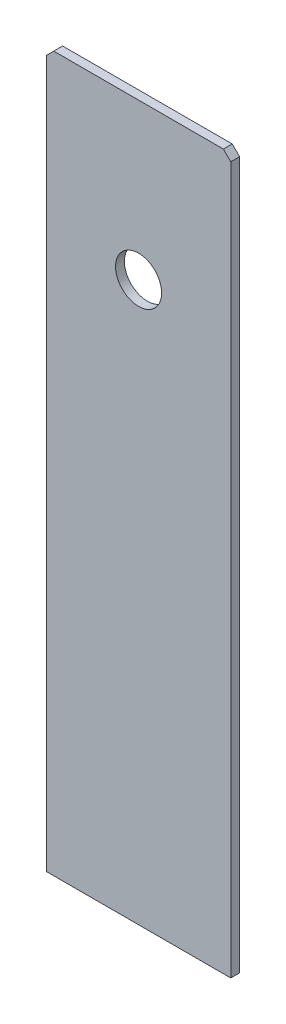
ISO-10303-21;
HEADER;
FILE_DESCRIPTION(('STEP AP214'),'2;1');
FILE_NAME('part.step','',(''),(''),'','','');
FILE_SCHEMA(('AUTOMOTIVE_DESIGN { 1 0 10303 214 1 1 1 1 }'));
ENDSEC;
DATA;
#1=APPLICATION_CONTEXT('core data for automotive mechanical design processes');
#2=APPLICATION_PROTOCOL_DEFINITION('international standard','automotive_design',2000,#1);
#3=PRODUCT_CONTEXT('',#1,'mechanical');
#4=PRODUCT('Part','Part','',(#3));
#5=PRODUCT_RELATED_PRODUCT_CATEGORY('part','',(#4));
#6=PRODUCT_DEFINITION_FORMATION('','',#4);
#7=PRODUCT_DEFINITION_CONTEXT('part definition',#1,'design');
#8=PRODUCT_DEFINITION('design','',#6,#7);
#9=PRODUCT_DEFINITION_SHAPE('','',#8);
#10=(LENGTH_UNIT() NAMED_UNIT(*) SI_UNIT(.MILLI.,.METRE.));
#11=(NAMED_UNIT(*) PLANE_ANGLE_UNIT() SI_UNIT($,.RADIAN.));
#12=(NAMED_UNIT(*) SI_UNIT($,.STERADIAN.) SOLID_ANGLE_UNIT());
#13=UNCERTAINTY_MEASURE_WITH_UNIT(LENGTH_MEASURE(1.E-05),#10,'distance_accuracy_value','');
#14=(GEOMETRIC_REPRESENTATION_CONTEXT(3) GLOBAL_UNCERTAINTY_ASSIGNED_CONTEXT((#13)) GLOBAL_UNIT_ASSIGNED_CONTEXT((#10,
#11,#12)) REPRESENTATION_CONTEXT('',''));
#15=CARTESIAN_POINT('',(0.,0.,0.));
#16=DIRECTION('',(0.,0.,1.));
#17=DIRECTION('',(1.,0.,0.));
#18=AXIS2_PLACEMENT_3D('',#15,#16,#17);
#19=CARTESIAN_POINT('',(0.,0.,3.048));
#20=DIRECTION('',(0.,0.,-1.));
#21=DIRECTION('',(-1.,0.,0.));
#22=AXIS2_PLACEMENT_3D('',#19,#20,#21);
#23=PLANE('',#22);
#24=DIRECTION('',(-1.,0.,0.));
#25=VECTOR('',#24,1.);
#26=CARTESIAN_POINT('',(0.,245.9736,3.048));
#27=LINE('',#26,#25);
#28=CARTESIAN_POINT('',(60.96,245.9736,3.048));
#29=VERTEX_POINT('',#28);
#30=CARTESIAN_POINT('',(2.53999999999996,245.9736,3.048));
#31=VERTEX_POINT('',#30);
#32=EDGE_CURVE('E117',#29,#31,#27,.T.);
#33=ORIENTED_EDGE('',*,*,#32,.T.);
#34=DIRECTION('',(0.707106781186547,0.707106781186548,0.));
#35=VECTOR('',#34,1.);
#36=CARTESIAN_POINT('',(0.,243.4336,3.048));
#37=LINE('',#36,#35);
#38=CARTESIAN_POINT('',(0.,243.4336,3.048));
#39=VERTEX_POINT('',#38);
#40=EDGE_CURVE('E43',#31,#39,#37,.F.);
#41=ORIENTED_EDGE('',*,*,#40,.T.);
#42=DIRECTION('',(0.,-1.,0.));
#43=VECTOR('',#42,1.);
#44=CARTESIAN_POINT('',(0.,0.,3.048));
#45=LINE('',#44,#43);
#46=CARTESIAN_POINT('',(0.,0.,3.048));
#47=VERTEX_POINT('',#46);
#48=EDGE_CURVE('E89',#39,#47,#45,.T.);
#49=ORIENTED_EDGE('',*,*,#48,.T.);
#50=DIRECTION('',(1.,0.,0.));
#51=VECTOR('',#50,1.);
#52=CARTESIAN_POINT('',(0.,0.,3.048));
#53=LINE('',#52,#51);
#54=CARTESIAN_POINT('',(63.5,0.,3.048));
#55=VERTEX_POINT('',#54);
#56=EDGE_CURVE('E92',#47,#55,#53,.T.);
#57=ORIENTED_EDGE('',*,*,#56,.T.);
#58=DIRECTION('',(0.,1.,0.));
#59=VECTOR('',#58,1.);
#60=CARTESIAN_POINT('',(63.5,0.,3.048));
#61=LINE('',#60,#59);
#62=CARTESIAN_POINT('',(63.5,243.4336,3.048));
#63=VERTEX_POINT('',#62);
#64=EDGE_CURVE('E107',#55,#63,#61,.T.);
#65=ORIENTED_EDGE('',*,*,#64,.T.);
#66=DIRECTION('',(0.707106781186544,-0.707106781186551,0.));
#67=VECTOR('',#66,1.);
#68=CARTESIAN_POINT('',(60.96,245.9736,3.048));
#69=LINE('',#68,#67);
#70=EDGE_CURVE('E128',#63,#29,#69,.F.);
#71=ORIENTED_EDGE('',*,*,#70,.T.);
#72=EDGE_LOOP('',(#33,#41,#49,#57,#65,#71));
#73=FACE_BOUND('',#72,.T.);
#74=CARTESIAN_POINT('',(31.75,192.3796,3.048));
#75=DIRECTION('',(0.,0.,1.));
#76=DIRECTION('',(1.,0.,0.));
#77=AXIS2_PLACEMENT_3D('',#74,#75,#76);
#78=CIRCLE('',#77,7.9375);
#79=CARTESIAN_POINT('',(39.6875,192.3796,3.048));
#80=VERTEX_POINT('',#79);
#81=EDGE_CURVE('E145',#80,#80,#78,.T.);
#82=ORIENTED_EDGE('',*,*,#81,.F.);
#83=EDGE_LOOP('',(#82));
#84=FACE_BOUND('',#83,.T.);
#85=ADVANCED_FACE('F35',(#73,#84),#23,.F.);
#86=CARTESIAN_POINT('',(0.,0.,0.));
#87=DIRECTION('',(0.,0.,-1.));
#88=DIRECTION('',(-1.,0.,0.));
#89=AXIS2_PLACEMENT_3D('',#86,#87,#88);
#90=PLANE('',#89);
#91=DIRECTION('',(0.,-1.,0.));
#92=VECTOR('',#91,1.);
#93=CARTESIAN_POINT('',(0.,0.,0.));
#94=LINE('',#93,#92);
#95=CARTESIAN_POINT('',(0.,243.4336,0.));
#96=VERTEX_POINT('',#95);
#97=CARTESIAN_POINT('',(0.,0.,0.));
#98=VERTEX_POINT('',#97);
#99=EDGE_CURVE('E111',#96,#98,#94,.T.);
#100=ORIENTED_EDGE('',*,*,#99,.F.);
#101=DIRECTION('',(-0.707106781186547,-0.707106781186548,0.));
#102=VECTOR('',#101,1.);
#103=CARTESIAN_POINT('',(-121.7168,121.7168,0.));
#104=LINE('',#103,#102);
#105=CARTESIAN_POINT('',(2.53999999999996,245.9736,0.));
#106=VERTEX_POINT('',#105);
#107=EDGE_CURVE('E122',#96,#106,#104,.F.);
#108=ORIENTED_EDGE('',*,*,#107,.T.);
#109=DIRECTION('',(-1.,0.,0.));
#110=VECTOR('',#109,1.);
#111=CARTESIAN_POINT('',(0.,245.9736,0.));
#112=LINE('',#111,#110);
#113=CARTESIAN_POINT('',(60.96,245.9736,0.));
#114=VERTEX_POINT('',#113);
#115=EDGE_CURVE('E99',#114,#106,#112,.T.);
#116=ORIENTED_EDGE('',*,*,#115,.F.);
#117=DIRECTION('',(-0.707106781186544,0.707106781186551,0.));
#118=VECTOR('',#117,1.);
#119=CARTESIAN_POINT('',(153.4668,153.466799999999,0.));
#120=LINE('',#119,#118);
#121=CARTESIAN_POINT('',(63.5,243.4336,0.));
#122=VERTEX_POINT('',#121);
#123=EDGE_CURVE('E115',#114,#122,#120,.F.);
#124=ORIENTED_EDGE('',*,*,#123,.T.);
#125=DIRECTION('',(0.,1.,0.));
#126=VECTOR('',#125,1.);
#127=CARTESIAN_POINT('',(63.5,0.,0.));
#128=LINE('',#127,#126);
#129=CARTESIAN_POINT('',(63.5,0.,0.));
#130=VERTEX_POINT('',#129);
#131=EDGE_CURVE('E139',#130,#122,#128,.T.);
#132=ORIENTED_EDGE('',*,*,#131,.F.);
#133=DIRECTION('',(1.,0.,0.));
#134=VECTOR('',#133,1.);
#135=CARTESIAN_POINT('',(0.,0.,0.));
#136=LINE('',#135,#134);
#137=EDGE_CURVE('E141',#98,#130,#136,.T.);
#138=ORIENTED_EDGE('',*,*,#137,.F.);
#139=EDGE_LOOP('',(#100,#108,#116,#124,#132,#138));
#140=FACE_BOUND('',#139,.T.);
#141=CARTESIAN_POINT('',(31.75,192.3796,0.));
#142=DIRECTION('',(0.,0.,1.));
#143=DIRECTION('',(1.,0.,0.));
#144=AXIS2_PLACEMENT_3D('',#141,#142,#143);
#145=CIRCLE('',#144,7.9375);
#146=CARTESIAN_POINT('',(39.6875,192.3796,0.));
#147=VERTEX_POINT('',#146);
#148=EDGE_CURVE('E148',#147,#147,#145,.T.);
#149=ORIENTED_EDGE('',*,*,#148,.T.);
#150=EDGE_LOOP('',(#149));
#151=FACE_BOUND('',#150,.T.);
#152=ADVANCED_FACE('F137',(#140,#151),#90,.T.);
#153=CARTESIAN_POINT('',(0.,0.,3.048));
#154=DIRECTION('',(1.,0.,0.));
#155=DIRECTION('',(0.,0.,-1.));
#156=AXIS2_PLACEMENT_3D('',#153,#154,#155);
#157=PLANE('',#156);
#158=ORIENTED_EDGE('',*,*,#48,.F.);
#159=DIRECTION('',(0.,0.,-1.));
#160=VECTOR('',#159,1.);
#161=CARTESIAN_POINT('',(0.,243.4336,3.048));
#162=LINE('',#161,#160);
#163=EDGE_CURVE('E113',#39,#96,#162,.T.);
#164=ORIENTED_EDGE('',*,*,#163,.T.);
#165=ORIENTED_EDGE('',*,*,#99,.T.);
#166=DIRECTION('',(0.,0.,-1.));
#167=VECTOR('',#166,1.);
#168=CARTESIAN_POINT('',(0.,0.,3.048));
#169=LINE('',#168,#167);
#170=EDGE_CURVE('E104',#47,#98,#169,.T.);
#171=ORIENTED_EDGE('',*,*,#170,.F.);
#172=EDGE_LOOP('',(#158,#164,#165,#171));
#173=FACE_BOUND('',#172,.T.);
#174=ADVANCED_FACE('F109',(#173),#157,.F.);
#175=CARTESIAN_POINT('',(0.,0.,3.048));
#176=DIRECTION('',(0.,1.,0.));
#177=DIRECTION('',(0.,0.,1.));
#178=AXIS2_PLACEMENT_3D('',#175,#176,#177);
#179=PLANE('',#178);
#180=ORIENTED_EDGE('',*,*,#137,.T.);
#181=DIRECTION('',(0.,0.,-1.));
#182=VECTOR('',#181,1.);
#183=CARTESIAN_POINT('',(63.5,0.,3.048));
#184=LINE('',#183,#182);
#185=EDGE_CURVE('E106',#55,#130,#184,.T.);
#186=ORIENTED_EDGE('',*,*,#185,.F.);
#187=ORIENTED_EDGE('',*,*,#56,.F.);
#188=ORIENTED_EDGE('',*,*,#170,.T.);
#189=EDGE_LOOP('',(#180,#186,#187,#188));
#190=FACE_BOUND('',#189,.T.);
#191=ADVANCED_FACE('F103',(#190),#179,.F.);
#192=CARTESIAN_POINT('',(63.5,0.,3.048));
#193=DIRECTION('',(-1.,0.,0.));
#194=DIRECTION('',(0.,0.,1.));
#195=AXIS2_PLACEMENT_3D('',#192,#193,#194);
#196=PLANE('',#195);
#197=ORIENTED_EDGE('',*,*,#131,.T.);
#198=DIRECTION('',(0.,0.,1.));
#199=VECTOR('',#198,1.);
#200=CARTESIAN_POINT('',(63.5,243.4336,3.048));
#201=LINE('',#200,#199);
#202=EDGE_CURVE('E11',#122,#63,#201,.T.);
#203=ORIENTED_EDGE('',*,*,#202,.T.);
#204=ORIENTED_EDGE('',*,*,#64,.F.);
#205=ORIENTED_EDGE('',*,*,#185,.T.);
#206=EDGE_LOOP('',(#197,#203,#204,#205));
#207=FACE_BOUND('',#206,.T.);
#208=ADVANCED_FACE('F140',(#207),#196,.F.);
#209=CARTESIAN_POINT('',(0.,245.9736,3.048));
#210=DIRECTION('',(0.,-1.,0.));
#211=DIRECTION('',(0.,0.,-1.));
#212=AXIS2_PLACEMENT_3D('',#209,#210,#211);
#213=PLANE('',#212);
#214=ORIENTED_EDGE('',*,*,#115,.T.);
#215=DIRECTION('',(0.,0.,1.));
#216=VECTOR('',#215,1.);
#217=CARTESIAN_POINT('',(2.53999999999996,245.9736,3.048));
#218=LINE('',#217,#216);
#219=EDGE_CURVE('E56',#106,#31,#218,.T.);
#220=ORIENTED_EDGE('',*,*,#219,.T.);
#221=ORIENTED_EDGE('',*,*,#32,.F.);
#222=DIRECTION('',(0.,0.,-1.));
#223=VECTOR('',#222,1.);
#224=CARTESIAN_POINT('',(60.96,245.9736,3.048));
#225=LINE('',#224,#223);
#226=EDGE_CURVE('E124',#29,#114,#225,.T.);
#227=ORIENTED_EDGE('',*,*,#226,.T.);
#228=EDGE_LOOP('',(#214,#220,#221,#227));
#229=FACE_BOUND('',#228,.T.);
#230=ADVANCED_FACE('F132',(#229),#213,.F.);
#231=CARTESIAN_POINT('',(31.75,192.3796,3.048));
#232=DIRECTION('',(0.,0.,-1.));
#233=DIRECTION('',(-1.,0.,0.));
#234=AXIS2_PLACEMENT_3D('',#231,#232,#233);
#235=CYLINDRICAL_SURFACE('',#234,7.9375);
#236=ORIENTED_EDGE('',*,*,#81,.T.);
#237=EDGE_LOOP('',(#236));
#238=FACE_BOUND('',#237,.T.);
#239=ORIENTED_EDGE('',*,*,#148,.F.);
#240=EDGE_LOOP('',(#239));
#241=FACE_BOUND('',#240,.T.);
#242=ADVANCED_FACE('F154',(#238,#241),#235,.F.);
#243=CARTESIAN_POINT('',(0.,243.4336,3.048));
#244=DIRECTION('',(0.707106781186548,-0.707106781186547,0.));
#245=DIRECTION('',(0.,0.,-1.));
#246=AXIS2_PLACEMENT_3D('',#243,#244,#245);
#247=PLANE('',#246);
#248=ORIENTED_EDGE('',*,*,#40,.F.);
#249=ORIENTED_EDGE('',*,*,#219,.F.);
#250=ORIENTED_EDGE('',*,*,#107,.F.);
#251=ORIENTED_EDGE('',*,*,#163,.F.);
#252=EDGE_LOOP('',(#248,#249,#250,#251));
#253=FACE_BOUND('',#252,.T.);
#254=ADVANCED_FACE('F171',(#253),#247,.F.);
#255=CARTESIAN_POINT('',(60.96,245.9736,3.048));
#256=DIRECTION('',(-0.707106781186551,-0.707106781186544,0.));
#257=DIRECTION('',(0.,0.,-1.));
#258=AXIS2_PLACEMENT_3D('',#255,#256,#257);
#259=PLANE('',#258);
#260=ORIENTED_EDGE('',*,*,#70,.F.);
#261=ORIENTED_EDGE('',*,*,#202,.F.);
#262=ORIENTED_EDGE('',*,*,#123,.F.);
#263=ORIENTED_EDGE('',*,*,#226,.F.);
#264=EDGE_LOOP('',(#260,#261,#262,#263));
#265=FACE_BOUND('',#264,.T.);
#266=ADVANCED_FACE('F37',(#265),#259,.F.);
#267=CLOSED_SHELL('',(#85,#152,#174,#191,#208,#230,#242,#254,#266));
#268=MANIFOLD_SOLID_BREP('B2',#267);
#269=ADVANCED_BREP_SHAPE_REPRESENTATION('',(#18,#268),#14);
#270=SHAPE_DEFINITION_REPRESENTATION(#9,#269);
ENDSEC;
END-ISO-10303-21;
